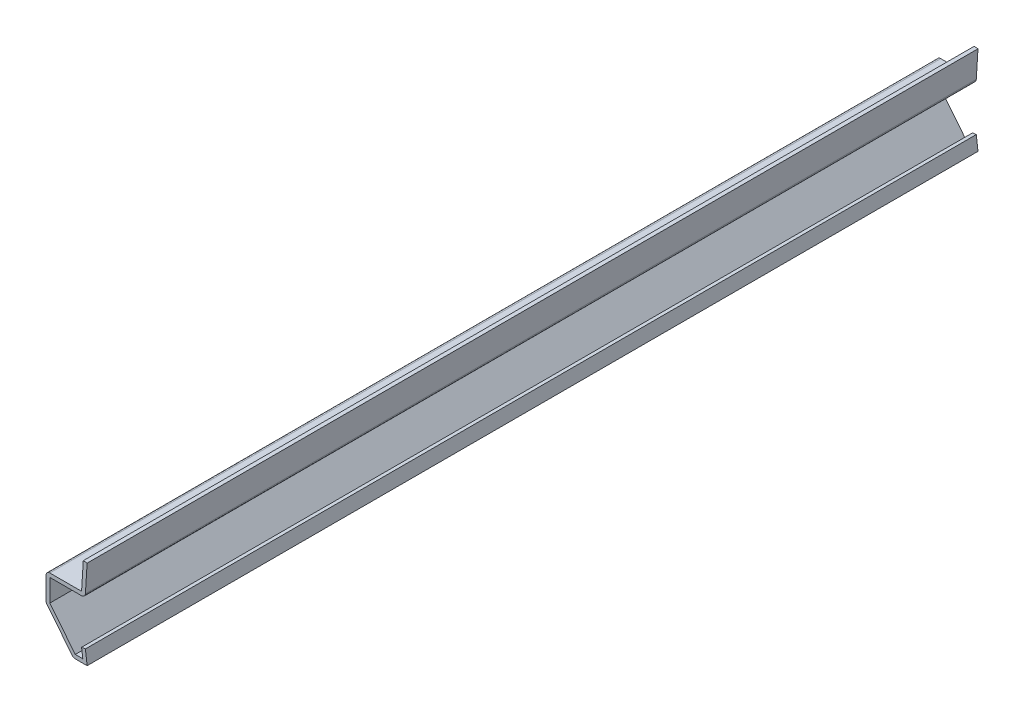
ISO-10303-21;
HEADER;
FILE_DESCRIPTION(('STEP AP214'),'2;1');
FILE_NAME('part.step','',(''),(''),'','','');
FILE_SCHEMA(('AUTOMOTIVE_DESIGN { 1 0 10303 214 1 1 1 1 }'));
ENDSEC;
DATA;
#1=APPLICATION_CONTEXT('core data for automotive mechanical design processes');
#2=APPLICATION_PROTOCOL_DEFINITION('international standard','automotive_design',2000,#1);
#3=PRODUCT_CONTEXT('',#1,'mechanical');
#4=PRODUCT('Part','Part','',(#3));
#5=PRODUCT_RELATED_PRODUCT_CATEGORY('part','',(#4));
#6=PRODUCT_DEFINITION_FORMATION('','',#4);
#7=PRODUCT_DEFINITION_CONTEXT('part definition',#1,'design');
#8=PRODUCT_DEFINITION('design','',#6,#7);
#9=PRODUCT_DEFINITION_SHAPE('','',#8);
#10=(LENGTH_UNIT() NAMED_UNIT(*) SI_UNIT(.MILLI.,.METRE.));
#11=(NAMED_UNIT(*) PLANE_ANGLE_UNIT() SI_UNIT($,.RADIAN.));
#12=(NAMED_UNIT(*) SI_UNIT($,.STERADIAN.) SOLID_ANGLE_UNIT());
#13=UNCERTAINTY_MEASURE_WITH_UNIT(LENGTH_MEASURE(1.E-05),#10,'distance_accuracy_value','');
#14=(GEOMETRIC_REPRESENTATION_CONTEXT(3) GLOBAL_UNCERTAINTY_ASSIGNED_CONTEXT((#13)) GLOBAL_UNIT_ASSIGNED_CONTEXT((#10,
#11,#12)) REPRESENTATION_CONTEXT('',''));
#15=CARTESIAN_POINT('',(0.,0.,0.));
#16=DIRECTION('',(0.,0.,1.));
#17=DIRECTION('',(1.,0.,0.));
#18=AXIS2_PLACEMENT_3D('',#15,#16,#17);
#19=CARTESIAN_POINT('',(-0.398606257728711,14.232045703608,-206.375));
#20=DIRECTION('',(0.998052578482889,-0.0623782861551804,0.));
#21=DIRECTION('',(0.0623782861551804,0.998052578482889,0.));
#22=AXIS2_PLACEMENT_3D('',#19,#20,#21);
#23=PLANE('',#22);
#24=DIRECTION('',(0.0623782861551804,0.998052578482889,0.));
#25=VECTOR('',#24,1.);
#26=CARTESIAN_POINT('',(-0.398606257728711,14.232045703608,0.));
#27=LINE('',#26,#25);
#28=CARTESIAN_POINT('',(-0.398606257728711,14.232045703608,0.));
#29=VERTEX_POINT('',#28);
#30=CARTESIAN_POINT('',(-0.001731257728712,20.582045703608,0.));
#31=VERTEX_POINT('',#30);
#32=EDGE_CURVE('E269',#29,#31,#27,.T.);
#33=ORIENTED_EDGE('',*,*,#32,.F.);
#34=DIRECTION('',(0.,0.,1.));
#35=VECTOR('',#34,1.);
#36=CARTESIAN_POINT('',(-0.398606257728711,14.232045703608,-206.375));
#37=LINE('',#36,#35);
#38=CARTESIAN_POINT('',(-0.398606257728711,14.232045703608,-206.375));
#39=VERTEX_POINT('',#38);
#40=EDGE_CURVE('E43',#29,#39,#37,.F.);
#41=ORIENTED_EDGE('',*,*,#40,.T.);
#42=DIRECTION('',(0.0623782861551804,0.998052578482889,0.));
#43=VECTOR('',#42,1.);
#44=CARTESIAN_POINT('',(-0.398606257728711,14.232045703608,-206.375));
#45=LINE('',#44,#43);
#46=CARTESIAN_POINT('',(-0.001731257728712,20.582045703608,-206.375));
#47=VERTEX_POINT('',#46);
#48=EDGE_CURVE('E162',#39,#47,#45,.T.);
#49=ORIENTED_EDGE('',*,*,#48,.T.);
#50=DIRECTION('',(0.,0.,1.));
#51=VECTOR('',#50,1.);
#52=CARTESIAN_POINT('',(-0.001731257728712,20.582045703608,-206.375));
#53=LINE('',#52,#51);
#54=EDGE_CURVE('E166',#47,#31,#53,.T.);
#55=ORIENTED_EDGE('',*,*,#54,.T.);
#56=EDGE_LOOP('',(#33,#41,#49,#55));
#57=FACE_BOUND('',#56,.T.);
#58=ADVANCED_FACE('F35',(#57),#23,.T.);
#59=CARTESIAN_POINT('',(-9.525,13.3985,-206.375));
#60=DIRECTION('',(0.,-1.,0.));
#61=DIRECTION('',(0.,0.,-1.));
#62=AXIS2_PLACEMENT_3D('',#59,#60,#61);
#63=PLANE('',#62);
#64=DIRECTION('',(1.,0.,0.));
#65=VECTOR('',#64,1.);
#66=CARTESIAN_POINT('',(-9.525,13.3985,-206.375));
#67=LINE('',#66,#65);
#68=CARTESIAN_POINT('',(-8.636,13.3985,-206.375));
#69=VERTEX_POINT('',#68);
#70=CARTESIAN_POINT('',(-1.285875,13.3985,-206.375));
#71=VERTEX_POINT('',#70);
#72=EDGE_CURVE('E186',#69,#71,#67,.T.);
#73=ORIENTED_EDGE('',*,*,#72,.T.);
#74=DIRECTION('',(0.,0.,1.));
#75=VECTOR('',#74,1.);
#76=CARTESIAN_POINT('',(-1.285875,13.3985,-206.375));
#77=LINE('',#76,#75);
#78=CARTESIAN_POINT('',(-1.285875,13.3985,0.));
#79=VERTEX_POINT('',#78);
#80=EDGE_CURVE('E222',#71,#79,#77,.T.);
#81=ORIENTED_EDGE('',*,*,#80,.T.);
#82=DIRECTION('',(1.,0.,0.));
#83=VECTOR('',#82,1.);
#84=CARTESIAN_POINT('',(-9.525,13.3985,0.));
#85=LINE('',#84,#83);
#86=CARTESIAN_POINT('',(-8.636,13.3985,0.));
#87=VERTEX_POINT('',#86);
#88=EDGE_CURVE('E171',#87,#79,#85,.T.);
#89=ORIENTED_EDGE('',*,*,#88,.F.);
#90=DIRECTION('',(0.,0.,1.));
#91=VECTOR('',#90,1.);
#92=CARTESIAN_POINT('',(-8.636,13.3985,-206.375));
#93=LINE('',#92,#91);
#94=EDGE_CURVE('E198',#69,#87,#93,.T.);
#95=ORIENTED_EDGE('',*,*,#94,.F.);
#96=EDGE_LOOP('',(#73,#81,#89,#95));
#97=FACE_BOUND('',#96,.T.);
#98=ADVANCED_FACE('F228',(#97),#63,.T.);
#99=CARTESIAN_POINT('',(-8.636,7.9375,-206.375));
#100=DIRECTION('',(1.,0.,0.));
#101=DIRECTION('',(0.,1.,0.));
#102=AXIS2_PLACEMENT_3D('',#99,#100,#101);
#103=PLANE('',#102);
#104=DIRECTION('',(0.,1.,0.));
#105=VECTOR('',#104,1.);
#106=CARTESIAN_POINT('',(-8.636,7.9375,0.));
#107=LINE('',#106,#105);
#108=CARTESIAN_POINT('',(-8.636,8.24934436176945,0.));
#109=VERTEX_POINT('',#108);
#110=EDGE_CURVE('E237',#109,#87,#107,.T.);
#111=ORIENTED_EDGE('',*,*,#110,.F.);
#112=DIRECTION('',(0.,0.,1.));
#113=VECTOR('',#112,1.);
#114=CARTESIAN_POINT('',(-8.636,8.24934436176945,-206.375));
#115=LINE('',#114,#113);
#116=CARTESIAN_POINT('',(-8.636,8.24934436176945,-206.375));
#117=VERTEX_POINT('',#116);
#118=EDGE_CURVE('E244',#117,#109,#115,.T.);
#119=ORIENTED_EDGE('',*,*,#118,.F.);
#120=DIRECTION('',(0.,1.,0.));
#121=VECTOR('',#120,1.);
#122=CARTESIAN_POINT('',(-8.636,7.9375,-206.375));
#123=LINE('',#122,#121);
#124=EDGE_CURVE('E191',#117,#69,#123,.T.);
#125=ORIENTED_EDGE('',*,*,#124,.T.);
#126=ORIENTED_EDGE('',*,*,#94,.T.);
#127=EDGE_LOOP('',(#111,#119,#125,#126));
#128=FACE_BOUND('',#127,.T.);
#129=ADVANCED_FACE('F299',(#128),#103,.T.);
#130=CARTESIAN_POINT('',(-2.48080762840515,0.555353897275883,-206.375));
#131=DIRECTION('',(0.78086880944303,0.624695047554424,0.));
#132=DIRECTION('',(-0.624695047554424,0.78086880944303,0.));
#133=AXIS2_PLACEMENT_3D('',#130,#131,#132);
#134=PLANE('',#133);
#135=DIRECTION('',(-0.624695047554424,0.78086880944303,0.));
#136=VECTOR('',#135,1.);
#137=CARTESIAN_POINT('',(-2.48080762840515,0.555353897275883,0.));
#138=LINE('',#137,#136);
#139=CARTESIAN_POINT('',(-2.74772451058444,0.889,0.));
#140=VERTEX_POINT('',#139);
#141=EDGE_CURVE('E239',#140,#109,#138,.T.);
#142=ORIENTED_EDGE('',*,*,#141,.F.);
#143=DIRECTION('',(0.,0.,1.));
#144=VECTOR('',#143,1.);
#145=CARTESIAN_POINT('',(-2.74772451058444,0.889,-206.375));
#146=LINE('',#145,#144);
#147=CARTESIAN_POINT('',(-2.74772451058444,0.889,-206.375));
#148=VERTEX_POINT('',#147);
#149=EDGE_CURVE('E246',#148,#140,#146,.T.);
#150=ORIENTED_EDGE('',*,*,#149,.F.);
#151=DIRECTION('',(-0.624695047554424,0.78086880944303,0.));
#152=VECTOR('',#151,1.);
#153=CARTESIAN_POINT('',(-2.48080762840515,0.555353897275883,-206.375));
#154=LINE('',#153,#152);
#155=EDGE_CURVE('E295',#148,#117,#154,.T.);
#156=ORIENTED_EDGE('',*,*,#155,.T.);
#157=ORIENTED_EDGE('',*,*,#118,.T.);
#158=EDGE_LOOP('',(#142,#150,#156,#157));
#159=FACE_BOUND('',#158,.T.);
#160=ADVANCED_FACE('F292',(#159),#134,.T.);
#161=CARTESIAN_POINT('',(0.,0.889,-206.375));
#162=DIRECTION('',(0.,1.,0.));
#163=DIRECTION('',(-1.,0.,0.));
#164=AXIS2_PLACEMENT_3D('',#161,#162,#163);
#165=PLANE('',#164);
#166=DIRECTION('',(-1.,0.,0.));
#167=VECTOR('',#166,1.);
#168=CARTESIAN_POINT('',(0.,0.889,0.));
#169=LINE('',#168,#167);
#170=CARTESIAN_POINT('',(-1.00704339227968,0.889,0.));
#171=VERTEX_POINT('',#170);
#172=EDGE_CURVE('E287',#171,#140,#169,.T.);
#173=ORIENTED_EDGE('',*,*,#172,.F.);
#174=DIRECTION('',(0.,0.,1.));
#175=VECTOR('',#174,1.);
#176=CARTESIAN_POINT('',(-1.00704339227968,0.889,-206.375));
#177=LINE('',#176,#175);
#178=CARTESIAN_POINT('',(-1.00704339227968,0.889,-206.375));
#179=VERTEX_POINT('',#178);
#180=EDGE_CURVE('E248',#179,#171,#177,.T.);
#181=ORIENTED_EDGE('',*,*,#180,.F.);
#182=DIRECTION('',(-1.,0.,0.));
#183=VECTOR('',#182,1.);
#184=CARTESIAN_POINT('',(0.,0.889,-206.375));
#185=LINE('',#184,#183);
#186=EDGE_CURVE('E353',#179,#148,#185,.T.);
#187=ORIENTED_EDGE('',*,*,#186,.T.);
#188=ORIENTED_EDGE('',*,*,#149,.T.);
#189=EDGE_LOOP('',(#173,#181,#187,#188));
#190=FACE_BOUND('',#189,.T.);
#191=ADVANCED_FACE('F358',(#190),#165,.T.);
#192=CARTESIAN_POINT('',(-1.27901003239845,3.06473312095019,-206.375));
#193=DIRECTION('',(-0.992277876713668,-0.124034734589208,0.));
#194=DIRECTION('',(0.124034734589208,-0.992277876713668,0.));
#195=AXIS2_PLACEMENT_3D('',#192,#193,#194);
#196=PLANE('',#195);
#197=DIRECTION('',(0.124034734589208,-0.992277876713668,0.));
#198=VECTOR('',#197,1.);
#199=CARTESIAN_POINT('',(-1.27901003239845,3.06473312095019,0.));
#200=LINE('',#199,#198);
#201=CARTESIAN_POINT('',(-1.27901003239845,3.06473312095019,0.));
#202=VERTEX_POINT('',#201);
#203=EDGE_CURVE('E284',#202,#171,#200,.T.);
#204=ORIENTED_EDGE('',*,*,#203,.F.);
#205=DIRECTION('',(0.,0.,1.));
#206=VECTOR('',#205,1.);
#207=CARTESIAN_POINT('',(-1.27901003239845,3.06473312095019,-206.375));
#208=LINE('',#207,#206);
#209=CARTESIAN_POINT('',(-1.27901003239845,3.06473312095019,-206.375));
#210=VERTEX_POINT('',#209);
#211=EDGE_CURVE('E250',#210,#202,#208,.T.);
#212=ORIENTED_EDGE('',*,*,#211,.F.);
#213=DIRECTION('',(0.124034734589208,-0.992277876713668,0.));
#214=VECTOR('',#213,1.);
#215=CARTESIAN_POINT('',(-1.27901003239845,3.06473312095019,-206.375));
#216=LINE('',#215,#214);
#217=EDGE_CURVE('E350',#210,#179,#216,.T.);
#218=ORIENTED_EDGE('',*,*,#217,.T.);
#219=ORIENTED_EDGE('',*,*,#180,.T.);
#220=EDGE_LOOP('',(#204,#212,#218,#219));
#221=FACE_BOUND('',#220,.T.);
#222=ADVANCED_FACE('F362',(#221),#196,.T.);
#223=CARTESIAN_POINT('',(-1.27901003239845,3.06473312095019,-206.375));
#224=DIRECTION('',(0.124034734589208,-0.992277876713668,0.));
#225=DIRECTION('',(0.992277876713668,0.124034734589208,0.));
#226=AXIS2_PLACEMENT_3D('',#223,#224,#225);
#227=PLANE('',#226);
#228=DIRECTION('',(0.992277876713668,0.124034734589208,0.));
#229=VECTOR('',#228,1.);
#230=CARTESIAN_POINT('',(-1.27901003239845,3.06473312095019,0.));
#231=LINE('',#230,#229);
#232=CARTESIAN_POINT('',(-0.396874999999999,3.175,0.));
#233=VERTEX_POINT('',#232);
#234=EDGE_CURVE('E282',#202,#233,#231,.T.);
#235=ORIENTED_EDGE('',*,*,#234,.T.);
#236=DIRECTION('',(0.,0.,1.));
#237=VECTOR('',#236,1.);
#238=CARTESIAN_POINT('',(-0.396874999999999,3.175,-206.375));
#239=LINE('',#238,#237);
#240=CARTESIAN_POINT('',(-0.396874999999999,3.175,-206.375));
#241=VERTEX_POINT('',#240);
#242=EDGE_CURVE('E252',#241,#233,#239,.T.);
#243=ORIENTED_EDGE('',*,*,#242,.F.);
#244=DIRECTION('',(0.992277876713668,0.124034734589208,0.));
#245=VECTOR('',#244,1.);
#246=CARTESIAN_POINT('',(-1.27901003239845,3.06473312095019,-206.375));
#247=LINE('',#246,#245);
#248=EDGE_CURVE('E348',#210,#241,#247,.T.);
#249=ORIENTED_EDGE('',*,*,#248,.F.);
#250=ORIENTED_EDGE('',*,*,#211,.T.);
#251=EDGE_LOOP('',(#235,#243,#249,#250));
#252=FACE_BOUND('',#251,.T.);
#253=ADVANCED_FACE('F367',(#252),#227,.F.);
#254=CARTESIAN_POINT('',(-0.396874999999999,3.175,-206.375));
#255=DIRECTION('',(-0.992277876713668,-0.124034734589208,0.));
#256=DIRECTION('',(0.124034734589208,-0.992277876713668,0.));
#257=AXIS2_PLACEMENT_3D('',#254,#255,#256);
#258=PLANE('',#257);
#259=DIRECTION('',(0.124034734589208,-0.992277876713668,0.));
#260=VECTOR('',#259,1.);
#261=CARTESIAN_POINT('',(-0.396874999999999,3.175,0.));
#262=LINE('',#261,#260);
#263=CARTESIAN_POINT('',(0.,0.,0.));
#264=VERTEX_POINT('',#263);
#265=EDGE_CURVE('E280',#233,#264,#262,.T.);
#266=ORIENTED_EDGE('',*,*,#265,.T.);
#267=DIRECTION('',(0.,0.,1.));
#268=VECTOR('',#267,1.);
#269=CARTESIAN_POINT('',(0.,0.,-206.375));
#270=LINE('',#269,#268);
#271=CARTESIAN_POINT('',(0.,0.,-206.375));
#272=VERTEX_POINT('',#271);
#273=EDGE_CURVE('E255',#272,#264,#270,.T.);
#274=ORIENTED_EDGE('',*,*,#273,.F.);
#275=DIRECTION('',(0.124034734589208,-0.992277876713668,0.));
#276=VECTOR('',#275,1.);
#277=CARTESIAN_POINT('',(-0.396874999999999,3.175,-206.375));
#278=LINE('',#277,#276);
#279=EDGE_CURVE('E341',#241,#272,#278,.T.);
#280=ORIENTED_EDGE('',*,*,#279,.F.);
#281=ORIENTED_EDGE('',*,*,#242,.T.);
#282=EDGE_LOOP('',(#266,#274,#280,#281));
#283=FACE_BOUND('',#282,.T.);
#284=ADVANCED_FACE('F371',(#283),#258,.F.);
#285=CARTESIAN_POINT('',(0.,0.,-206.375));
#286=DIRECTION('',(0.,1.,0.));
#287=DIRECTION('',(-1.,0.,0.));
#288=AXIS2_PLACEMENT_3D('',#285,#286,#287);
#289=PLANE('',#288);
#290=DIRECTION('',(-1.,0.,0.));
#291=VECTOR('',#290,1.);
#292=CARTESIAN_POINT('',(0.,0.,0.));
#293=LINE('',#292,#291);
#294=CARTESIAN_POINT('',(-2.74772451058444,0.,0.));
#295=VERTEX_POINT('',#294);
#296=EDGE_CURVE('E277',#264,#295,#293,.T.);
#297=ORIENTED_EDGE('',*,*,#296,.T.);
#298=DIRECTION('',(0.,0.,1.));
#299=VECTOR('',#298,1.);
#300=CARTESIAN_POINT('',(-2.74772451058444,0.,-206.375));
#301=LINE('',#300,#299);
#302=CARTESIAN_POINT('',(-2.74772451058444,0.,-206.375));
#303=VERTEX_POINT('',#302);
#304=EDGE_CURVE('E209',#295,#303,#301,.F.);
#305=ORIENTED_EDGE('',*,*,#304,.T.);
#306=DIRECTION('',(-1.,0.,0.));
#307=VECTOR('',#306,1.);
#308=CARTESIAN_POINT('',(0.,0.,-206.375));
#309=LINE('',#308,#307);
#310=EDGE_CURVE('E335',#272,#303,#309,.T.);
#311=ORIENTED_EDGE('',*,*,#310,.F.);
#312=ORIENTED_EDGE('',*,*,#273,.T.);
#313=EDGE_LOOP('',(#297,#305,#311,#312));
#314=FACE_BOUND('',#313,.T.);
#315=ADVANCED_FACE('F375',(#314),#289,.F.);
#316=CARTESIAN_POINT('',(-3.175,0.,-206.375));
#317=DIRECTION('',(0.78086880944303,0.624695047554424,0.));
#318=DIRECTION('',(-0.624695047554424,0.78086880944303,0.));
#319=AXIS2_PLACEMENT_3D('',#316,#317,#318);
#320=PLANE('',#319);
#321=DIRECTION('',(-0.624695047554424,0.78086880944303,0.));
#322=VECTOR('',#321,1.);
#323=CARTESIAN_POINT('',(-3.175,0.,-206.375));
#324=LINE('',#323,#322);
#325=CARTESIAN_POINT('',(-3.44191688217929,0.333646102724116,-206.375));
#326=VERTEX_POINT('',#325);
#327=CARTESIAN_POINT('',(-9.33019237159485,7.69399046449357,-206.375));
#328=VERTEX_POINT('',#327);
#329=EDGE_CURVE('E332',#326,#328,#324,.T.);
#330=ORIENTED_EDGE('',*,*,#329,.F.);
#331=DIRECTION('',(0.,0.,1.));
#332=VECTOR('',#331,1.);
#333=CARTESIAN_POINT('',(-3.44191688217929,0.333646102724116,-206.375));
#334=LINE('',#333,#332);
#335=CARTESIAN_POINT('',(-3.44191688217929,0.333646102724116,0.));
#336=VERTEX_POINT('',#335);
#337=EDGE_CURVE('E197',#326,#336,#334,.T.);
#338=ORIENTED_EDGE('',*,*,#337,.T.);
#339=DIRECTION('',(-0.624695047554424,0.78086880944303,0.));
#340=VECTOR('',#339,1.);
#341=CARTESIAN_POINT('',(-3.175,0.,0.));
#342=LINE('',#341,#340);
#343=CARTESIAN_POINT('',(-9.33019237159485,7.69399046449357,0.));
#344=VERTEX_POINT('',#343);
#345=EDGE_CURVE('E274',#336,#344,#342,.T.);
#346=ORIENTED_EDGE('',*,*,#345,.T.);
#347=DIRECTION('',(0.,0.,1.));
#348=VECTOR('',#347,1.);
#349=CARTESIAN_POINT('',(-9.33019237159485,7.69399046449356,-206.375));
#350=LINE('',#349,#348);
#351=EDGE_CURVE('E195',#344,#328,#350,.F.);
#352=ORIENTED_EDGE('',*,*,#351,.T.);
#353=EDGE_LOOP('',(#330,#338,#346,#352));
#354=FACE_BOUND('',#353,.T.);
#355=ADVANCED_FACE('F337',(#354),#320,.F.);
#356=CARTESIAN_POINT('',(-9.525,7.9375,-206.375));
#357=DIRECTION('',(1.,0.,0.));
#358=DIRECTION('',(0.,1.,0.));
#359=AXIS2_PLACEMENT_3D('',#356,#357,#358);
#360=PLANE('',#359);
#361=DIRECTION('',(0.,1.,0.));
#362=VECTOR('',#361,1.);
#363=CARTESIAN_POINT('',(-9.525,7.9375,-206.375));
#364=LINE('',#363,#362);
#365=CARTESIAN_POINT('',(-9.525,8.24934436176945,-206.375));
#366=VERTEX_POINT('',#365);
#367=CARTESIAN_POINT('',(-9.525,13.3985,-206.375));
#368=VERTEX_POINT('',#367);
#369=EDGE_CURVE('E339',#366,#368,#364,.T.);
#370=ORIENTED_EDGE('',*,*,#369,.F.);
#371=DIRECTION('',(0.,0.,1.));
#372=VECTOR('',#371,1.);
#373=CARTESIAN_POINT('',(-9.525,8.24934436176945,-206.375));
#374=LINE('',#373,#372);
#375=CARTESIAN_POINT('',(-9.525,8.24934436176945,0.));
#376=VERTEX_POINT('',#375);
#377=EDGE_CURVE('E219',#366,#376,#374,.T.);
#378=ORIENTED_EDGE('',*,*,#377,.T.);
#379=DIRECTION('',(0.,1.,0.));
#380=VECTOR('',#379,1.);
#381=CARTESIAN_POINT('',(-9.525,7.9375,0.));
#382=LINE('',#381,#380);
#383=CARTESIAN_POINT('',(-9.525,13.3985,0.));
#384=VERTEX_POINT('',#383);
#385=EDGE_CURVE('E267',#376,#384,#382,.T.);
#386=ORIENTED_EDGE('',*,*,#385,.T.);
#387=DIRECTION('',(0.,0.,1.));
#388=VECTOR('',#387,1.);
#389=CARTESIAN_POINT('',(-9.525,13.3985,-206.375));
#390=LINE('',#389,#388);
#391=EDGE_CURVE('E58',#384,#368,#390,.F.);
#392=ORIENTED_EDGE('',*,*,#391,.T.);
#393=EDGE_LOOP('',(#370,#378,#386,#392));
#394=FACE_BOUND('',#393,.T.);
#395=ADVANCED_FACE('F378',(#394),#360,.F.);
#396=CARTESIAN_POINT('',(-9.525,14.2875,-206.375));
#397=DIRECTION('',(0.,-1.,0.));
#398=DIRECTION('',(0.,0.,-1.));
#399=AXIS2_PLACEMENT_3D('',#396,#397,#398);
#400=PLANE('',#399);
#401=DIRECTION('',(1.,0.,0.));
#402=VECTOR('',#401,1.);
#403=CARTESIAN_POINT('',(-9.525,14.2875,-206.375));
#404=LINE('',#403,#402);
#405=CARTESIAN_POINT('',(-8.636,14.2875,-206.375));
#406=VERTEX_POINT('',#405);
#407=CARTESIAN_POINT('',(-1.285875,14.2875,-206.375));
#408=VERTEX_POINT('',#407);
#409=EDGE_CURVE('E343',#406,#408,#404,.T.);
#410=ORIENTED_EDGE('',*,*,#409,.F.);
#411=DIRECTION('',(0.,0.,1.));
#412=VECTOR('',#411,1.);
#413=CARTESIAN_POINT('',(-8.636,14.2875,-206.375));
#414=LINE('',#413,#412);
#415=CARTESIAN_POINT('',(-8.636,14.2875,0.));
#416=VERTEX_POINT('',#415);
#417=EDGE_CURVE('E11',#406,#416,#414,.T.);
#418=ORIENTED_EDGE('',*,*,#417,.T.);
#419=DIRECTION('',(1.,0.,0.));
#420=VECTOR('',#419,1.);
#421=CARTESIAN_POINT('',(-9.525,14.2875,0.));
#422=LINE('',#421,#420);
#423=CARTESIAN_POINT('',(-1.285875,14.2875,0.));
#424=VERTEX_POINT('',#423);
#425=EDGE_CURVE('E265',#416,#424,#422,.T.);
#426=ORIENTED_EDGE('',*,*,#425,.T.);
#427=DIRECTION('',(0.,0.,1.));
#428=VECTOR('',#427,1.);
#429=CARTESIAN_POINT('',(-1.285875,14.2875,-206.375));
#430=LINE('',#429,#428);
#431=EDGE_CURVE('E188',#408,#424,#430,.T.);
#432=ORIENTED_EDGE('',*,*,#431,.F.);
#433=EDGE_LOOP('',(#410,#418,#426,#432));
#434=FACE_BOUND('',#433,.T.);
#435=ADVANCED_FACE('F380',(#434),#400,.F.);
#436=CARTESIAN_POINT('',(-1.285875,14.2875,-206.375));
#437=DIRECTION('',(0.998052578482889,-0.0623782861551804,0.));
#438=DIRECTION('',(0.0623782861551804,0.998052578482889,0.));
#439=AXIS2_PLACEMENT_3D('',#436,#437,#438);
#440=PLANE('',#439);
#441=DIRECTION('',(0.0623782861551804,0.998052578482889,0.));
#442=VECTOR('',#441,1.);
#443=CARTESIAN_POINT('',(-1.285875,14.2875,0.));
#444=LINE('',#443,#442);
#445=CARTESIAN_POINT('',(-0.889,20.6375,0.));
#446=VERTEX_POINT('',#445);
#447=EDGE_CURVE('E262',#424,#446,#444,.T.);
#448=ORIENTED_EDGE('',*,*,#447,.T.);
#449=DIRECTION('',(0.,0.,1.));
#450=VECTOR('',#449,1.);
#451=CARTESIAN_POINT('',(-0.889,20.6375,-206.375));
#452=LINE('',#451,#450);
#453=CARTESIAN_POINT('',(-0.889,20.6375,-206.375));
#454=VERTEX_POINT('',#453);
#455=EDGE_CURVE('E185',#454,#446,#452,.T.);
#456=ORIENTED_EDGE('',*,*,#455,.F.);
#457=DIRECTION('',(0.0623782861551804,0.998052578482889,0.));
#458=VECTOR('',#457,1.);
#459=CARTESIAN_POINT('',(-1.285875,14.2875,-206.375));
#460=LINE('',#459,#458);
#461=EDGE_CURVE('E177',#408,#454,#460,.T.);
#462=ORIENTED_EDGE('',*,*,#461,.F.);
#463=ORIENTED_EDGE('',*,*,#431,.T.);
#464=EDGE_LOOP('',(#448,#456,#462,#463));
#465=FACE_BOUND('',#464,.T.);
#466=ADVANCED_FACE('F261',(#465),#440,.F.);
#467=CARTESIAN_POINT('',(-0.889,20.6375,-206.375));
#468=DIRECTION('',(-0.0623782861551811,-0.998052578482889,0.));
#469=DIRECTION('',(0.998052578482889,-0.0623782861551811,0.));
#470=AXIS2_PLACEMENT_3D('',#467,#468,#469);
#471=PLANE('',#470);
#472=DIRECTION('',(0.998052578482889,-0.0623782861551811,0.));
#473=VECTOR('',#472,1.);
#474=CARTESIAN_POINT('',(-0.889,20.6375,0.));
#475=LINE('',#474,#473);
#476=EDGE_CURVE('E184',#446,#31,#475,.T.);
#477=ORIENTED_EDGE('',*,*,#476,.T.);
#478=ORIENTED_EDGE('',*,*,#54,.F.);
#479=DIRECTION('',(0.998052578482889,-0.0623782861551811,0.));
#480=VECTOR('',#479,1.);
#481=CARTESIAN_POINT('',(-0.889,20.6375,-206.375));
#482=LINE('',#481,#480);
#483=EDGE_CURVE('E170',#454,#47,#482,.T.);
#484=ORIENTED_EDGE('',*,*,#483,.F.);
#485=ORIENTED_EDGE('',*,*,#455,.T.);
#486=EDGE_LOOP('',(#477,#478,#484,#485));
#487=FACE_BOUND('',#486,.T.);
#488=ADVANCED_FACE('F182',(#487),#471,.F.);
#489=CARTESIAN_POINT('',(0.,0.,-206.375));
#490=DIRECTION('',(0.,0.,-1.));
#491=DIRECTION('',(-1.,0.,0.));
#492=AXIS2_PLACEMENT_3D('',#489,#490,#491);
#493=PLANE('',#492);
#494=ORIENTED_EDGE('',*,*,#310,.T.);
#495=CARTESIAN_POINT('',(-2.74772451058444,0.889,-206.375));
#496=DIRECTION('',(0.,0.,-1.));
#497=DIRECTION('',(-1.,0.,0.));
#498=AXIS2_PLACEMENT_3D('',#495,#496,#497);
#499=CIRCLE('',#498,0.889);
#500=EDGE_CURVE('E216',#303,#326,#499,.T.);
#501=ORIENTED_EDGE('',*,*,#500,.T.);
#502=ORIENTED_EDGE('',*,*,#329,.T.);
#503=CARTESIAN_POINT('',(-8.636,8.24934436176945,-206.375));
#504=DIRECTION('',(0.,0.,-1.));
#505=DIRECTION('',(-1.,0.,0.));
#506=AXIS2_PLACEMENT_3D('',#503,#504,#505);
#507=CIRCLE('',#506,0.889);
#508=EDGE_CURVE('E214',#328,#366,#507,.T.);
#509=ORIENTED_EDGE('',*,*,#508,.T.);
#510=ORIENTED_EDGE('',*,*,#369,.T.);
#511=CARTESIAN_POINT('',(-8.636,13.3985,-206.375));
#512=DIRECTION('',(0.,0.,-1.));
#513=DIRECTION('',(-1.,0.,0.));
#514=AXIS2_PLACEMENT_3D('',#511,#512,#513);
#515=CIRCLE('',#514,0.889);
#516=EDGE_CURVE('E50',#368,#406,#515,.T.);
#517=ORIENTED_EDGE('',*,*,#516,.T.);
#518=ORIENTED_EDGE('',*,*,#409,.T.);
#519=ORIENTED_EDGE('',*,*,#461,.T.);
#520=ORIENTED_EDGE('',*,*,#483,.T.);
#521=ORIENTED_EDGE('',*,*,#48,.F.);
#522=CARTESIAN_POINT('',(-1.285875,14.2875,-206.375));
#523=DIRECTION('',(0.,0.,-1.));
#524=DIRECTION('',(-1.,0.,0.));
#525=AXIS2_PLACEMENT_3D('',#522,#523,#524);
#526=CIRCLE('',#525,0.889);
#527=EDGE_CURVE('E212',#39,#71,#526,.T.);
#528=ORIENTED_EDGE('',*,*,#527,.T.);
#529=ORIENTED_EDGE('',*,*,#72,.F.);
#530=ORIENTED_EDGE('',*,*,#124,.F.);
#531=ORIENTED_EDGE('',*,*,#155,.F.);
#532=ORIENTED_EDGE('',*,*,#186,.F.);
#533=ORIENTED_EDGE('',*,*,#217,.F.);
#534=ORIENTED_EDGE('',*,*,#248,.T.);
#535=ORIENTED_EDGE('',*,*,#279,.T.);
#536=EDGE_LOOP('',(#494,#501,#502,#509,#510,#517,#518,#519,#520,#521,#528,#529,#530,#531,#532,
#533,#534,#535));
#537=FACE_BOUND('',#536,.T.);
#538=ADVANCED_FACE('F175',(#537),#493,.T.);
#539=CARTESIAN_POINT('',(0.,0.,0.));
#540=DIRECTION('',(0.,0.,-1.));
#541=DIRECTION('',(-1.,0.,0.));
#542=AXIS2_PLACEMENT_3D('',#539,#540,#541);
#543=PLANE('',#542);
#544=ORIENTED_EDGE('',*,*,#345,.F.);
#545=CARTESIAN_POINT('',(-2.74772451058444,0.889,0.));
#546=DIRECTION('',(0.,0.,-1.));
#547=DIRECTION('',(-1.,0.,0.));
#548=AXIS2_PLACEMENT_3D('',#545,#546,#547);
#549=CIRCLE('',#548,0.889);
#550=EDGE_CURVE('E207',#336,#295,#549,.F.);
#551=ORIENTED_EDGE('',*,*,#550,.T.);
#552=ORIENTED_EDGE('',*,*,#296,.F.);
#553=ORIENTED_EDGE('',*,*,#265,.F.);
#554=ORIENTED_EDGE('',*,*,#234,.F.);
#555=ORIENTED_EDGE('',*,*,#203,.T.);
#556=ORIENTED_EDGE('',*,*,#172,.T.);
#557=ORIENTED_EDGE('',*,*,#141,.T.);
#558=ORIENTED_EDGE('',*,*,#110,.T.);
#559=ORIENTED_EDGE('',*,*,#88,.T.);
#560=CARTESIAN_POINT('',(-1.285875,14.2875,0.));
#561=DIRECTION('',(0.,0.,-1.));
#562=DIRECTION('',(-1.,0.,0.));
#563=AXIS2_PLACEMENT_3D('',#560,#561,#562);
#564=CIRCLE('',#563,0.889);
#565=EDGE_CURVE('E203',#79,#29,#564,.F.);
#566=ORIENTED_EDGE('',*,*,#565,.T.);
#567=ORIENTED_EDGE('',*,*,#32,.T.);
#568=ORIENTED_EDGE('',*,*,#476,.F.);
#569=ORIENTED_EDGE('',*,*,#447,.F.);
#570=ORIENTED_EDGE('',*,*,#425,.F.);
#571=CARTESIAN_POINT('',(-8.636,13.3985,0.));
#572=DIRECTION('',(0.,0.,-1.));
#573=DIRECTION('',(-1.,0.,0.));
#574=AXIS2_PLACEMENT_3D('',#571,#572,#573);
#575=CIRCLE('',#574,0.889);
#576=EDGE_CURVE('E201',#416,#384,#575,.F.);
#577=ORIENTED_EDGE('',*,*,#576,.T.);
#578=ORIENTED_EDGE('',*,*,#385,.F.);
#579=CARTESIAN_POINT('',(-8.636,8.24934436176945,0.));
#580=DIRECTION('',(0.,0.,-1.));
#581=DIRECTION('',(-1.,0.,0.));
#582=AXIS2_PLACEMENT_3D('',#579,#580,#581);
#583=CIRCLE('',#582,0.889);
#584=EDGE_CURVE('E205',#376,#344,#583,.F.);
#585=ORIENTED_EDGE('',*,*,#584,.T.);
#586=EDGE_LOOP('',(#544,#551,#552,#553,#554,#555,#556,#557,#558,#559,#566,#567,#568,#569,#570,
#577,#578,#585));
#587=FACE_BOUND('',#586,.T.);
#588=ADVANCED_FACE('F234',(#587),#543,.F.);
#589=CARTESIAN_POINT('',(-2.74772451058444,0.889,-206.375));
#590=DIRECTION('',(0.,0.,1.));
#591=DIRECTION('',(1.,0.,0.));
#592=AXIS2_PLACEMENT_3D('',#589,#590,#591);
#593=CYLINDRICAL_SURFACE('',#592,0.889);
#594=ORIENTED_EDGE('',*,*,#500,.F.);
#595=ORIENTED_EDGE('',*,*,#304,.F.);
#596=ORIENTED_EDGE('',*,*,#550,.F.);
#597=ORIENTED_EDGE('',*,*,#337,.F.);
#598=EDGE_LOOP('',(#594,#595,#596,#597));
#599=FACE_BOUND('',#598,.T.);
#600=ADVANCED_FACE('F309',(#599),#593,.T.);
#601=CARTESIAN_POINT('',(-8.636,8.24934436176945,-206.375));
#602=DIRECTION('',(0.,0.,1.));
#603=DIRECTION('',(1.,0.,0.));
#604=AXIS2_PLACEMENT_3D('',#601,#602,#603);
#605=CYLINDRICAL_SURFACE('',#604,0.889);
#606=ORIENTED_EDGE('',*,*,#508,.F.);
#607=ORIENTED_EDGE('',*,*,#351,.F.);
#608=ORIENTED_EDGE('',*,*,#584,.F.);
#609=ORIENTED_EDGE('',*,*,#377,.F.);
#610=EDGE_LOOP('',(#606,#607,#608,#609));
#611=FACE_BOUND('',#610,.T.);
#612=ADVANCED_FACE('F303',(#611),#605,.T.);
#613=CARTESIAN_POINT('',(-1.285875,14.2875,-206.375));
#614=DIRECTION('',(0.,0.,1.));
#615=DIRECTION('',(1.,0.,0.));
#616=AXIS2_PLACEMENT_3D('',#613,#614,#615);
#617=CYLINDRICAL_SURFACE('',#616,0.889);
#618=ORIENTED_EDGE('',*,*,#527,.F.);
#619=ORIENTED_EDGE('',*,*,#40,.F.);
#620=ORIENTED_EDGE('',*,*,#565,.F.);
#621=ORIENTED_EDGE('',*,*,#80,.F.);
#622=EDGE_LOOP('',(#618,#619,#620,#621));
#623=FACE_BOUND('',#622,.T.);
#624=ADVANCED_FACE('F301',(#623),#617,.T.);
#625=CARTESIAN_POINT('',(-8.636,13.3985,-206.375));
#626=DIRECTION('',(0.,0.,1.));
#627=DIRECTION('',(1.,0.,0.));
#628=AXIS2_PLACEMENT_3D('',#625,#626,#627);
#629=CYLINDRICAL_SURFACE('',#628,0.889);
#630=ORIENTED_EDGE('',*,*,#516,.F.);
#631=ORIENTED_EDGE('',*,*,#391,.F.);
#632=ORIENTED_EDGE('',*,*,#576,.F.);
#633=ORIENTED_EDGE('',*,*,#417,.F.);
#634=EDGE_LOOP('',(#630,#631,#632,#633));
#635=FACE_BOUND('',#634,.T.);
#636=ADVANCED_FACE('F37',(#635),#629,.T.);
#637=CLOSED_SHELL('',(#58,#98,#129,#160,#191,#222,#253,#284,#315,#355,#395,#435,#466,#488,#538,
#588,#600,#612,#624,#636));
#638=MANIFOLD_SOLID_BREP('B2',#637);
#639=ADVANCED_BREP_SHAPE_REPRESENTATION('',(#18,#638),#14);
#640=SHAPE_DEFINITION_REPRESENTATION(#9,#639);
ENDSEC;
END-ISO-10303-21;
